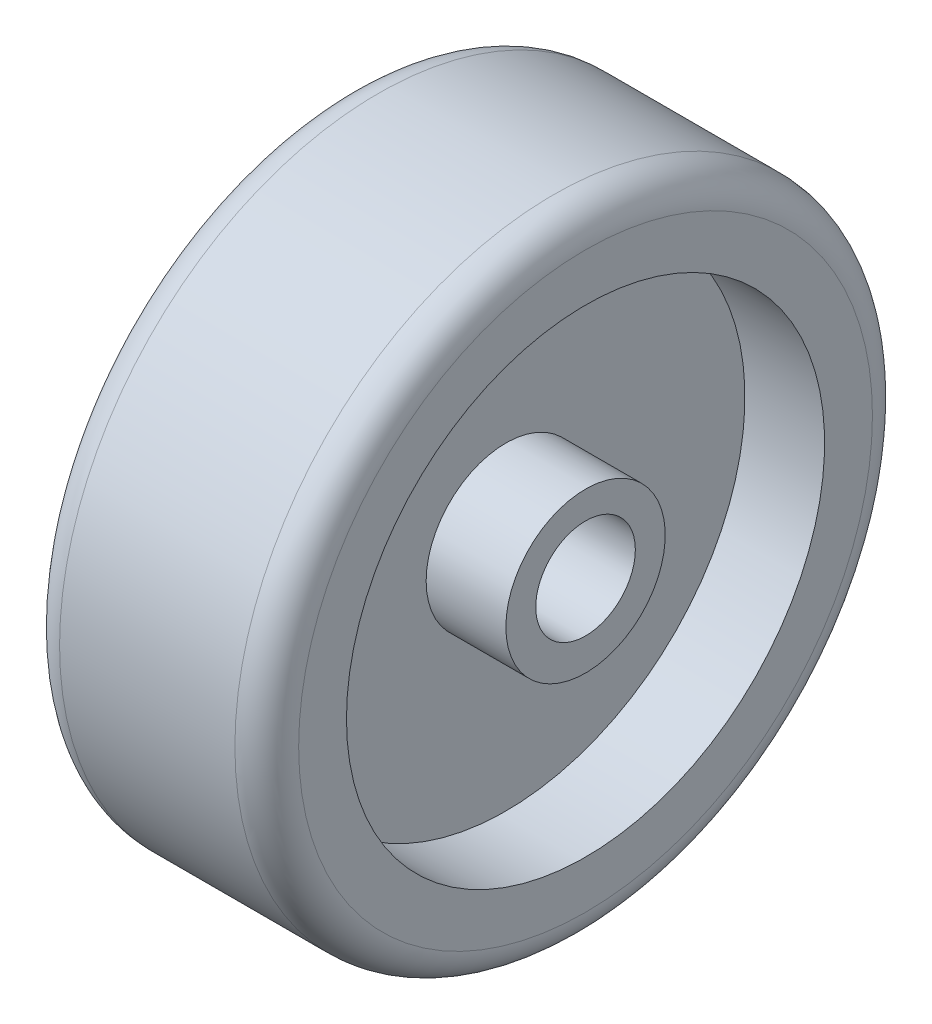
ISO-10303-21;
HEADER;
FILE_DESCRIPTION(('STEP AP214'),'2;1');
FILE_NAME('part.step','',(''),(''),'','','');
FILE_SCHEMA(('AUTOMOTIVE_DESIGN { 1 0 10303 214 1 1 1 1 }'));
ENDSEC;
DATA;
#1=APPLICATION_CONTEXT('core data for automotive mechanical design processes');
#2=APPLICATION_PROTOCOL_DEFINITION('international standard','automotive_design',2000,#1);
#3=PRODUCT_CONTEXT('',#1,'mechanical');
#4=PRODUCT('Part','Part','',(#3));
#5=PRODUCT_RELATED_PRODUCT_CATEGORY('part','',(#4));
#6=PRODUCT_DEFINITION_FORMATION('','',#4);
#7=PRODUCT_DEFINITION_CONTEXT('part definition',#1,'design');
#8=PRODUCT_DEFINITION('design','',#6,#7);
#9=PRODUCT_DEFINITION_SHAPE('','',#8);
#10=(LENGTH_UNIT() NAMED_UNIT(*) SI_UNIT(.MILLI.,.METRE.));
#11=(NAMED_UNIT(*) PLANE_ANGLE_UNIT() SI_UNIT($,.RADIAN.));
#12=(NAMED_UNIT(*) SI_UNIT($,.STERADIAN.) SOLID_ANGLE_UNIT());
#13=UNCERTAINTY_MEASURE_WITH_UNIT(LENGTH_MEASURE(1.E-05),#10,'distance_accuracy_value','');
#14=(GEOMETRIC_REPRESENTATION_CONTEXT(3) GLOBAL_UNCERTAINTY_ASSIGNED_CONTEXT((#13)) GLOBAL_UNIT_ASSIGNED_CONTEXT((#10,
#11,#12)) REPRESENTATION_CONTEXT('',''));
#15=CARTESIAN_POINT('',(0.,0.,0.));
#16=DIRECTION('',(0.,0.,1.));
#17=DIRECTION('',(1.,0.,0.));
#18=AXIS2_PLACEMENT_3D('',#15,#16,#17);
#19=CARTESIAN_POINT('',(38.1,-0.729526652101731,0.));
#20=DIRECTION('',(-1.,0.,0.));
#21=DIRECTION('',(0.,0.,1.));
#22=AXIS2_PLACEMENT_3D('',#19,#20,#21);
#23=PLANE('',#22);
#24=CARTESIAN_POINT('',(38.1,0.,0.));
#25=DIRECTION('',(1.,0.,0.));
#26=DIRECTION('',(0.,0.,-1.));
#27=AXIS2_PLACEMENT_3D('',#24,#25,#26);
#28=CIRCLE('',#27,15.875);
#29=CARTESIAN_POINT('',(38.1,0.,-15.875));
#30=VERTEX_POINT('',#29);
#31=EDGE_CURVE('E424',#30,#30,#28,.T.);
#32=ORIENTED_EDGE('',*,*,#31,.F.);
#33=EDGE_LOOP('',(#32));
#34=FACE_BOUND('',#33,.T.);
#35=CARTESIAN_POINT('',(38.1,-0.729526652101731,0.));
#36=DIRECTION('',(-1.,0.,0.));
#37=DIRECTION('',(0.,0.,1.));
#38=AXIS2_PLACEMENT_3D('',#35,#36,#37);
#39=CIRCLE('',#38,25.4);
#40=CARTESIAN_POINT('',(38.1,-0.729526652101731,25.4));
#41=VERTEX_POINT('',#40);
#42=EDGE_CURVE('E399',#41,#41,#39,.T.);
#43=ORIENTED_EDGE('',*,*,#42,.F.);
#44=EDGE_LOOP('',(#43));
#45=FACE_BOUND('',#44,.T.);
#46=ADVANCED_FACE('F379',(#34,#45),#23,.F.);
#47=CARTESIAN_POINT('',(-38.1,-0.729526652101731,0.));
#48=DIRECTION('',(-1.,0.,0.));
#49=DIRECTION('',(0.,0.,1.));
#50=AXIS2_PLACEMENT_3D('',#47,#48,#49);
#51=CYLINDRICAL_SURFACE('',#50,25.4);
#52=CARTESIAN_POINT('',(12.7,-0.729526652101731,0.));
#53=DIRECTION('',(-1.,0.,0.));
#54=DIRECTION('',(0.,0.,1.));
#55=AXIS2_PLACEMENT_3D('',#52,#53,#54);
#56=CIRCLE('',#55,25.4);
#57=CARTESIAN_POINT('',(12.7,-0.729526652101731,25.4));
#58=VERTEX_POINT('',#57);
#59=EDGE_CURVE('E402',#58,#58,#56,.T.);
#60=ORIENTED_EDGE('',*,*,#59,.F.);
#61=EDGE_LOOP('',(#60));
#62=FACE_BOUND('',#61,.T.);
#63=ORIENTED_EDGE('',*,*,#42,.T.);
#64=EDGE_LOOP('',(#63));
#65=FACE_BOUND('',#64,.T.);
#66=ADVANCED_FACE('F442',(#62,#65),#51,.T.);
#67=CARTESIAN_POINT('',(12.7,24.6704733478983,0.));
#68=DIRECTION('',(-1.,0.,0.));
#69=DIRECTION('',(0.,0.,1.));
#70=AXIS2_PLACEMENT_3D('',#67,#68,#69);
#71=PLANE('',#70);
#72=CARTESIAN_POINT('',(12.7,-0.729526652101731,0.));
#73=DIRECTION('',(-1.,0.,0.));
#74=DIRECTION('',(0.,0.,1.));
#75=AXIS2_PLACEMENT_3D('',#72,#73,#74);
#76=CIRCLE('',#75,76.2);
#77=CARTESIAN_POINT('',(12.7,-0.729526652101731,76.2));
#78=VERTEX_POINT('',#77);
#79=EDGE_CURVE('E405',#78,#78,#76,.T.);
#80=ORIENTED_EDGE('',*,*,#79,.F.);
#81=EDGE_LOOP('',(#80));
#82=FACE_BOUND('',#81,.T.);
#83=ORIENTED_EDGE('',*,*,#59,.T.);
#84=EDGE_LOOP('',(#83));
#85=FACE_BOUND('',#84,.T.);
#86=ADVANCED_FACE('F447',(#82,#85),#71,.F.);
#87=CARTESIAN_POINT('',(-38.1,-0.729526652101731,0.));
#88=DIRECTION('',(-1.,0.,0.));
#89=DIRECTION('',(0.,0.,1.));
#90=AXIS2_PLACEMENT_3D('',#87,#88,#89);
#91=CYLINDRICAL_SURFACE('',#90,76.2);
#92=CARTESIAN_POINT('',(38.1,-0.729526652101731,0.));
#93=DIRECTION('',(-1.,0.,0.));
#94=DIRECTION('',(0.,0.,1.));
#95=AXIS2_PLACEMENT_3D('',#92,#93,#94);
#96=CIRCLE('',#95,76.2);
#97=CARTESIAN_POINT('',(38.1,-0.729526652101731,76.2));
#98=VERTEX_POINT('',#97);
#99=EDGE_CURVE('E408',#98,#98,#96,.T.);
#100=ORIENTED_EDGE('',*,*,#99,.F.);
#101=EDGE_LOOP('',(#100));
#102=FACE_BOUND('',#101,.T.);
#103=ORIENTED_EDGE('',*,*,#79,.T.);
#104=EDGE_LOOP('',(#103));
#105=FACE_BOUND('',#104,.T.);
#106=ADVANCED_FACE('F453',(#102,#105),#91,.F.);
#107=CARTESIAN_POINT('',(38.1,75.4704733478983,0.));
#108=DIRECTION('',(-1.,0.,0.));
#109=DIRECTION('',(0.,0.,1.));
#110=AXIS2_PLACEMENT_3D('',#107,#108,#109);
#111=PLANE('',#110);
#112=CARTESIAN_POINT('',(38.1,-0.729526652101731,0.));
#113=DIRECTION('',(-1.,0.,0.));
#114=DIRECTION('',(0.,0.,1.));
#115=AXIS2_PLACEMENT_3D('',#112,#113,#114);
#116=CIRCLE('',#115,91.44);
#117=CARTESIAN_POINT('',(38.1,-0.729526652101731,91.44));
#118=VERTEX_POINT('',#117);
#119=EDGE_CURVE('E390',#118,#118,#116,.F.);
#120=ORIENTED_EDGE('',*,*,#119,.T.);
#121=EDGE_LOOP('',(#120));
#122=FACE_BOUND('',#121,.T.);
#123=ORIENTED_EDGE('',*,*,#99,.T.);
#124=EDGE_LOOP('',(#123));
#125=FACE_BOUND('',#124,.T.);
#126=ADVANCED_FACE('F471',(#122,#125),#111,.F.);
#127=CARTESIAN_POINT('',(-38.1,-0.729526652101731,0.));
#128=DIRECTION('',(-1.,0.,0.));
#129=DIRECTION('',(0.,0.,1.));
#130=AXIS2_PLACEMENT_3D('',#127,#128,#129);
#131=CYLINDRICAL_SURFACE('',#130,101.6);
#132=CARTESIAN_POINT('',(-27.94,-0.729526652101731,0.));
#133=DIRECTION('',(1.,0.,0.));
#134=DIRECTION('',(0.,0.,-1.));
#135=AXIS2_PLACEMENT_3D('',#132,#133,#134);
#136=CIRCLE('',#135,101.6);
#137=CARTESIAN_POINT('',(-27.94,-0.729526652101731,-101.6));
#138=VERTEX_POINT('',#137);
#139=EDGE_CURVE('E11',#138,#138,#136,.T.);
#140=ORIENTED_EDGE('',*,*,#139,.T.);
#141=EDGE_LOOP('',(#140));
#142=FACE_BOUND('',#141,.T.);
#143=CARTESIAN_POINT('',(27.94,-0.729526652101731,0.));
#144=DIRECTION('',(-1.,0.,0.));
#145=DIRECTION('',(0.,0.,1.));
#146=AXIS2_PLACEMENT_3D('',#143,#144,#145);
#147=CIRCLE('',#146,101.6);
#148=CARTESIAN_POINT('',(27.94,-0.729526652101731,101.6));
#149=VERTEX_POINT('',#148);
#150=EDGE_CURVE('E394',#149,#149,#147,.T.);
#151=ORIENTED_EDGE('',*,*,#150,.T.);
#152=EDGE_LOOP('',(#151));
#153=FACE_BOUND('',#152,.T.);
#154=ADVANCED_FACE('F468',(#142,#153),#131,.T.);
#155=CARTESIAN_POINT('',(-38.1,75.4704733478983,0.));
#156=DIRECTION('',(1.,0.,0.));
#157=DIRECTION('',(0.,0.,-1.));
#158=AXIS2_PLACEMENT_3D('',#155,#156,#157);
#159=PLANE('',#158);
#160=CARTESIAN_POINT('',(-38.1,-0.729526652101731,0.));
#161=DIRECTION('',(1.,0.,0.));
#162=DIRECTION('',(0.,0.,-1.));
#163=AXIS2_PLACEMENT_3D('',#160,#161,#162);
#164=CIRCLE('',#163,91.44);
#165=CARTESIAN_POINT('',(-38.1,-0.729526652101731,-91.44));
#166=VERTEX_POINT('',#165);
#167=EDGE_CURVE('E386',#166,#166,#164,.F.);
#168=ORIENTED_EDGE('',*,*,#167,.T.);
#169=EDGE_LOOP('',(#168));
#170=FACE_BOUND('',#169,.T.);
#171=CARTESIAN_POINT('',(-38.1,-0.729526652101731,0.));
#172=DIRECTION('',(-1.,0.,0.));
#173=DIRECTION('',(0.,0.,1.));
#174=AXIS2_PLACEMENT_3D('',#171,#172,#173);
#175=CIRCLE('',#174,76.2);
#176=CARTESIAN_POINT('',(-38.1,-0.729526652101731,76.2));
#177=VERTEX_POINT('',#176);
#178=EDGE_CURVE('E411',#177,#177,#175,.T.);
#179=ORIENTED_EDGE('',*,*,#178,.F.);
#180=EDGE_LOOP('',(#179));
#181=FACE_BOUND('',#180,.T.);
#182=ADVANCED_FACE('F470',(#170,#181),#159,.F.);
#183=CARTESIAN_POINT('',(-38.1,-0.729526652101731,0.));
#184=DIRECTION('',(-1.,0.,0.));
#185=DIRECTION('',(0.,0.,1.));
#186=AXIS2_PLACEMENT_3D('',#183,#184,#185);
#187=CYLINDRICAL_SURFACE('',#186,76.2);
#188=CARTESIAN_POINT('',(-12.7,-0.729526652101731,0.));
#189=DIRECTION('',(-1.,0.,0.));
#190=DIRECTION('',(0.,0.,1.));
#191=AXIS2_PLACEMENT_3D('',#188,#189,#190);
#192=CIRCLE('',#191,76.2);
#193=CARTESIAN_POINT('',(-12.7,-0.729526652101731,76.2));
#194=VERTEX_POINT('',#193);
#195=EDGE_CURVE('E414',#194,#194,#192,.T.);
#196=ORIENTED_EDGE('',*,*,#195,.F.);
#197=EDGE_LOOP('',(#196));
#198=FACE_BOUND('',#197,.T.);
#199=ORIENTED_EDGE('',*,*,#178,.T.);
#200=EDGE_LOOP('',(#199));
#201=FACE_BOUND('',#200,.T.);
#202=ADVANCED_FACE('F477',(#198,#201),#187,.F.);
#203=CARTESIAN_POINT('',(-12.7,24.6704733478983,0.));
#204=DIRECTION('',(1.,0.,0.));
#205=DIRECTION('',(0.,0.,-1.));
#206=AXIS2_PLACEMENT_3D('',#203,#204,#205);
#207=PLANE('',#206);
#208=CARTESIAN_POINT('',(-12.7,-0.729526652101731,0.));
#209=DIRECTION('',(-1.,0.,0.));
#210=DIRECTION('',(0.,0.,1.));
#211=AXIS2_PLACEMENT_3D('',#208,#209,#210);
#212=CIRCLE('',#211,25.4);
#213=CARTESIAN_POINT('',(-12.7,-0.729526652101731,25.4));
#214=VERTEX_POINT('',#213);
#215=EDGE_CURVE('E417',#214,#214,#212,.T.);
#216=ORIENTED_EDGE('',*,*,#215,.F.);
#217=EDGE_LOOP('',(#216));
#218=FACE_BOUND('',#217,.T.);
#219=ORIENTED_EDGE('',*,*,#195,.T.);
#220=EDGE_LOOP('',(#219));
#221=FACE_BOUND('',#220,.T.);
#222=ADVANCED_FACE('F530',(#218,#221),#207,.F.);
#223=CARTESIAN_POINT('',(-38.1,-0.729526652101731,0.));
#224=DIRECTION('',(-1.,0.,0.));
#225=DIRECTION('',(0.,0.,1.));
#226=AXIS2_PLACEMENT_3D('',#223,#224,#225);
#227=CYLINDRICAL_SURFACE('',#226,25.4);
#228=CARTESIAN_POINT('',(-38.1,-0.729526652101731,0.));
#229=DIRECTION('',(-1.,0.,0.));
#230=DIRECTION('',(0.,0.,1.));
#231=AXIS2_PLACEMENT_3D('',#228,#229,#230);
#232=CIRCLE('',#231,25.4);
#233=CARTESIAN_POINT('',(-38.1,-0.729526652101731,25.4));
#234=VERTEX_POINT('',#233);
#235=EDGE_CURVE('E420',#234,#234,#232,.T.);
#236=ORIENTED_EDGE('',*,*,#235,.F.);
#237=EDGE_LOOP('',(#236));
#238=FACE_BOUND('',#237,.T.);
#239=ORIENTED_EDGE('',*,*,#215,.T.);
#240=EDGE_LOOP('',(#239));
#241=FACE_BOUND('',#240,.T.);
#242=ADVANCED_FACE('F536',(#238,#241),#227,.T.);
#243=CARTESIAN_POINT('',(-38.1,-0.729526652101731,0.));
#244=DIRECTION('',(1.,0.,0.));
#245=DIRECTION('',(0.,0.,-1.));
#246=AXIS2_PLACEMENT_3D('',#243,#244,#245);
#247=PLANE('',#246);
#248=CARTESIAN_POINT('',(-38.1,0.,0.));
#249=DIRECTION('',(1.,0.,0.));
#250=DIRECTION('',(0.,0.,-1.));
#251=AXIS2_PLACEMENT_3D('',#248,#249,#250);
#252=CIRCLE('',#251,15.875);
#253=CARTESIAN_POINT('',(-38.1,0.,-15.875));
#254=VERTEX_POINT('',#253);
#255=EDGE_CURVE('E423',#254,#254,#252,.T.);
#256=ORIENTED_EDGE('',*,*,#255,.T.);
#257=EDGE_LOOP('',(#256));
#258=FACE_BOUND('',#257,.T.);
#259=ORIENTED_EDGE('',*,*,#235,.T.);
#260=EDGE_LOOP('',(#259));
#261=FACE_BOUND('',#260,.T.);
#262=ADVANCED_FACE('F430',(#258,#261),#247,.F.);
#263=CARTESIAN_POINT('',(-38.1,0.,0.));
#264=DIRECTION('',(1.,0.,0.));
#265=DIRECTION('',(0.,0.,-1.));
#266=AXIS2_PLACEMENT_3D('',#263,#264,#265);
#267=CYLINDRICAL_SURFACE('',#266,15.875);
#268=ORIENTED_EDGE('',*,*,#255,.F.);
#269=EDGE_LOOP('',(#268));
#270=FACE_BOUND('',#269,.T.);
#271=ORIENTED_EDGE('',*,*,#31,.T.);
#272=EDGE_LOOP('',(#271));
#273=FACE_BOUND('',#272,.T.);
#274=ADVANCED_FACE('F433',(#270,#273),#267,.F.);
#275=CARTESIAN_POINT('',(27.94,-0.729526652101731,0.));
#276=DIRECTION('',(-1.,0.,0.));
#277=DIRECTION('',(0.,0.,1.));
#278=AXIS2_PLACEMENT_3D('',#275,#276,#277);
#279=TOROIDAL_SURFACE('',#278,91.44,10.16);
#280=ORIENTED_EDGE('',*,*,#119,.F.);
#281=EDGE_LOOP('',(#280));
#282=FACE_BOUND('',#281,.T.);
#283=ORIENTED_EDGE('',*,*,#150,.F.);
#284=EDGE_LOOP('',(#283));
#285=FACE_BOUND('',#284,.T.);
#286=ADVANCED_FACE('F436',(#282,#285),#279,.T.);
#287=CARTESIAN_POINT('',(-27.94,-0.729526652101731,0.));
#288=DIRECTION('',(1.,0.,0.));
#289=DIRECTION('',(0.,0.,-1.));
#290=AXIS2_PLACEMENT_3D('',#287,#288,#289);
#291=TOROIDAL_SURFACE('',#290,91.44,10.16);
#292=ORIENTED_EDGE('',*,*,#139,.F.);
#293=EDGE_LOOP('',(#292));
#294=FACE_BOUND('',#293,.T.);
#295=ORIENTED_EDGE('',*,*,#167,.F.);
#296=EDGE_LOOP('',(#295));
#297=FACE_BOUND('',#296,.T.);
#298=ADVANCED_FACE('F381',(#294,#297),#291,.T.);
#299=CLOSED_SHELL('',(#46,#66,#86,#106,#126,#154,#182,#202,#222,#242,#262,#274,#286,#298));
#300=MANIFOLD_SOLID_BREP('B2',#299);
#301=ADVANCED_BREP_SHAPE_REPRESENTATION('',(#18,#300),#14);
#302=SHAPE_DEFINITION_REPRESENTATION(#9,#301);
ENDSEC;
END-ISO-10303-21;
